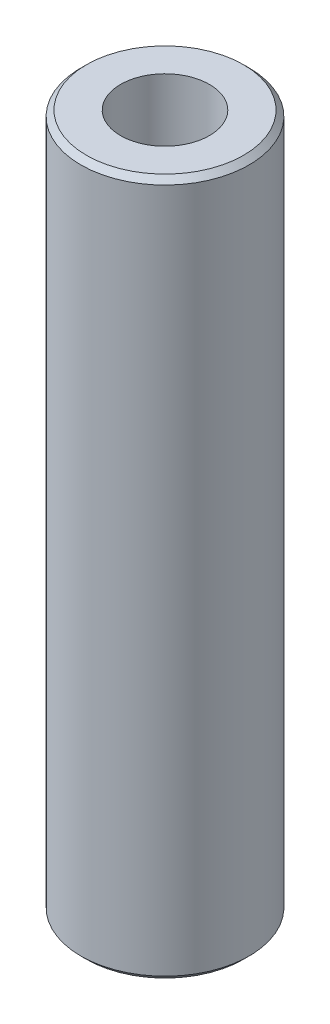
ISO-10303-21;
HEADER;
FILE_DESCRIPTION(('STEP AP214'),'2;1');
FILE_NAME('part.step','',(''),(''),'','','');
FILE_SCHEMA(('AUTOMOTIVE_DESIGN { 1 0 10303 214 1 1 1 1 }'));
ENDSEC;
DATA;
#1=APPLICATION_CONTEXT('core data for automotive mechanical design processes');
#2=APPLICATION_PROTOCOL_DEFINITION('international standard','automotive_design',2000,#1);
#3=PRODUCT_CONTEXT('',#1,'mechanical');
#4=PRODUCT('Part','Part','',(#3));
#5=PRODUCT_RELATED_PRODUCT_CATEGORY('part','',(#4));
#6=PRODUCT_DEFINITION_FORMATION('','',#4);
#7=PRODUCT_DEFINITION_CONTEXT('part definition',#1,'design');
#8=PRODUCT_DEFINITION('design','',#6,#7);
#9=PRODUCT_DEFINITION_SHAPE('','',#8);
#10=(LENGTH_UNIT() NAMED_UNIT(*) SI_UNIT(.MILLI.,.METRE.));
#11=(NAMED_UNIT(*) PLANE_ANGLE_UNIT() SI_UNIT($,.RADIAN.));
#12=(NAMED_UNIT(*) SI_UNIT($,.STERADIAN.) SOLID_ANGLE_UNIT());
#13=UNCERTAINTY_MEASURE_WITH_UNIT(LENGTH_MEASURE(1.E-05),#10,'distance_accuracy_value','');
#14=(GEOMETRIC_REPRESENTATION_CONTEXT(3) GLOBAL_UNCERTAINTY_ASSIGNED_CONTEXT((#13)) GLOBAL_UNIT_ASSIGNED_CONTEXT((#10,
#11,#12)) REPRESENTATION_CONTEXT('',''));
#15=CARTESIAN_POINT('',(0.,0.,0.));
#16=DIRECTION('',(0.,0.,1.));
#17=DIRECTION('',(1.,0.,0.));
#18=AXIS2_PLACEMENT_3D('',#15,#16,#17);
#19=CARTESIAN_POINT('',(0.,186.289802803506,0.));
#20=DIRECTION('',(0.,-1.,0.));
#21=DIRECTION('',(0.,0.,-1.));
#22=AXIS2_PLACEMENT_3D('',#19,#20,#21);
#23=CYLINDRICAL_SURFACE('',#22,22.5);
#24=CARTESIAN_POINT('',(0.,184.800624614373,0.));
#25=DIRECTION('',(0.,1.,0.));
#26=DIRECTION('',(0.,0.,1.));
#27=AXIS2_PLACEMENT_3D('',#24,#25,#26);
#28=CIRCLE('',#27,22.5);
#29=CARTESIAN_POINT('',(0.,184.800624614373,22.5));
#30=VERTEX_POINT('',#29);
#31=EDGE_CURVE('E50',#30,#30,#28,.F.);
#32=ORIENTED_EDGE('',*,*,#31,.T.);
#33=EDGE_LOOP('',(#32));
#34=FACE_BOUND('',#33,.T.);
#35=CARTESIAN_POINT('',(0.,1.48917818913283,0.));
#36=DIRECTION('',(0.,1.,0.));
#37=DIRECTION('',(0.,0.,1.));
#38=AXIS2_PLACEMENT_3D('',#35,#36,#37);
#39=CIRCLE('',#38,22.5);
#40=CARTESIAN_POINT('',(0.,1.48917818913283,22.5));
#41=VERTEX_POINT('',#40);
#42=EDGE_CURVE('E51',#41,#41,#39,.T.);
#43=ORIENTED_EDGE('',*,*,#42,.T.);
#44=EDGE_LOOP('',(#43));
#45=FACE_BOUND('',#44,.T.);
#46=ADVANCED_FACE('F39',(#34,#45),#23,.T.);
#47=CARTESIAN_POINT('',(0.,186.289802803506,0.));
#48=DIRECTION('',(0.,1.,0.));
#49=DIRECTION('',(0.,0.,1.));
#50=AXIS2_PLACEMENT_3D('',#47,#48,#49);
#51=PLANE('',#50);
#52=CARTESIAN_POINT('',(0.,186.289802803506,0.));
#53=DIRECTION('',(0.,1.,0.));
#54=DIRECTION('',(0.,0.,1.));
#55=AXIS2_PLACEMENT_3D('',#52,#53,#54);
#56=CIRCLE('',#55,21.0108218108672);
#57=CARTESIAN_POINT('',(0.,186.289802803506,21.0108218108672));
#58=VERTEX_POINT('',#57);
#59=EDGE_CURVE('E54',#58,#58,#56,.T.);
#60=ORIENTED_EDGE('',*,*,#59,.T.);
#61=EDGE_LOOP('',(#60));
#62=FACE_BOUND('',#61,.T.);
#63=CARTESIAN_POINT('',(0.,186.289802803506,0.));
#64=DIRECTION('',(0.,1.,0.));
#65=DIRECTION('',(0.,0.,1.));
#66=AXIS2_PLACEMENT_3D('',#63,#64,#65);
#67=CIRCLE('',#66,11.8876125745998);
#68=CARTESIAN_POINT('',(0.,186.289802803506,11.8876125745998));
#69=VERTEX_POINT('',#68);
#70=EDGE_CURVE('E58',#69,#69,#67,.T.);
#71=ORIENTED_EDGE('',*,*,#70,.F.);
#72=EDGE_LOOP('',(#71));
#73=FACE_BOUND('',#72,.T.);
#74=ADVANCED_FACE('F69',(#62,#73),#51,.T.);
#75=CARTESIAN_POINT('',(0.,0.,0.));
#76=DIRECTION('',(0.,1.,0.));
#77=DIRECTION('',(0.,0.,1.));
#78=AXIS2_PLACEMENT_3D('',#75,#76,#77);
#79=PLANE('',#78);
#80=CARTESIAN_POINT('',(0.,0.,0.));
#81=DIRECTION('',(0.,1.,0.));
#82=DIRECTION('',(0.,0.,1.));
#83=AXIS2_PLACEMENT_3D('',#80,#81,#82);
#84=CIRCLE('',#83,21.0108218108672);
#85=CARTESIAN_POINT('',(0.,0.,21.0108218108672));
#86=VERTEX_POINT('',#85);
#87=EDGE_CURVE('E10',#86,#86,#84,.F.);
#88=ORIENTED_EDGE('',*,*,#87,.T.);
#89=EDGE_LOOP('',(#88));
#90=FACE_BOUND('',#89,.T.);
#91=CARTESIAN_POINT('',(0.,0.,0.));
#92=DIRECTION('',(0.,1.,0.));
#93=DIRECTION('',(0.,0.,1.));
#94=AXIS2_PLACEMENT_3D('',#91,#92,#93);
#95=CIRCLE('',#94,11.8876125745998);
#96=CARTESIAN_POINT('',(0.,0.,11.8876125745998));
#97=VERTEX_POINT('',#96);
#98=EDGE_CURVE('E63',#97,#97,#95,.T.);
#99=ORIENTED_EDGE('',*,*,#98,.T.);
#100=EDGE_LOOP('',(#99));
#101=FACE_BOUND('',#100,.T.);
#102=ADVANCED_FACE('F75',(#90,#101),#79,.F.);
#103=CARTESIAN_POINT('',(0.,186.289802803506,0.));
#104=DIRECTION('',(0.,-1.,0.));
#105=DIRECTION('',(0.,0.,-1.));
#106=AXIS2_PLACEMENT_3D('',#103,#104,#105);
#107=CYLINDRICAL_SURFACE('',#106,11.8876125745998);
#108=ORIENTED_EDGE('',*,*,#70,.T.);
#109=EDGE_LOOP('',(#108));
#110=FACE_BOUND('',#109,.T.);
#111=ORIENTED_EDGE('',*,*,#98,.F.);
#112=EDGE_LOOP('',(#111));
#113=FACE_BOUND('',#112,.T.);
#114=ADVANCED_FACE('F70',(#110,#113),#107,.F.);
#115=CARTESIAN_POINT('',(0.,186.289802803506,0.));
#116=DIRECTION('',(0.,-1.,0.));
#117=DIRECTION('',(0.,0.,-1.));
#118=AXIS2_PLACEMENT_3D('',#115,#116,#117);
#119=CONICAL_SURFACE('',#118,21.0108218108672,0.785398163397443);
#120=ORIENTED_EDGE('',*,*,#31,.F.);
#121=EDGE_LOOP('',(#120));
#122=FACE_BOUND('',#121,.T.);
#123=ORIENTED_EDGE('',*,*,#59,.F.);
#124=EDGE_LOOP('',(#123));
#125=FACE_BOUND('',#124,.T.);
#126=ADVANCED_FACE('F81',(#122,#125),#119,.T.);
#127=CARTESIAN_POINT('',(0.,1.48917818913283,0.));
#128=DIRECTION('',(0.,1.,0.));
#129=DIRECTION('',(0.,0.,1.));
#130=AXIS2_PLACEMENT_3D('',#127,#128,#129);
#131=CONICAL_SURFACE('',#130,22.5,0.785398163397444);
#132=ORIENTED_EDGE('',*,*,#87,.F.);
#133=EDGE_LOOP('',(#132));
#134=FACE_BOUND('',#133,.T.);
#135=ORIENTED_EDGE('',*,*,#42,.F.);
#136=EDGE_LOOP('',(#135));
#137=FACE_BOUND('',#136,.T.);
#138=ADVANCED_FACE('F45',(#134,#137),#131,.T.);
#139=CLOSED_SHELL('',(#46,#74,#102,#114,#126,#138));
#140=MANIFOLD_SOLID_BREP('B2',#139);
#141=ADVANCED_BREP_SHAPE_REPRESENTATION('',(#18,#140),#14);
#142=SHAPE_DEFINITION_REPRESENTATION(#9,#141);
ENDSEC;
END-ISO-10303-21;
